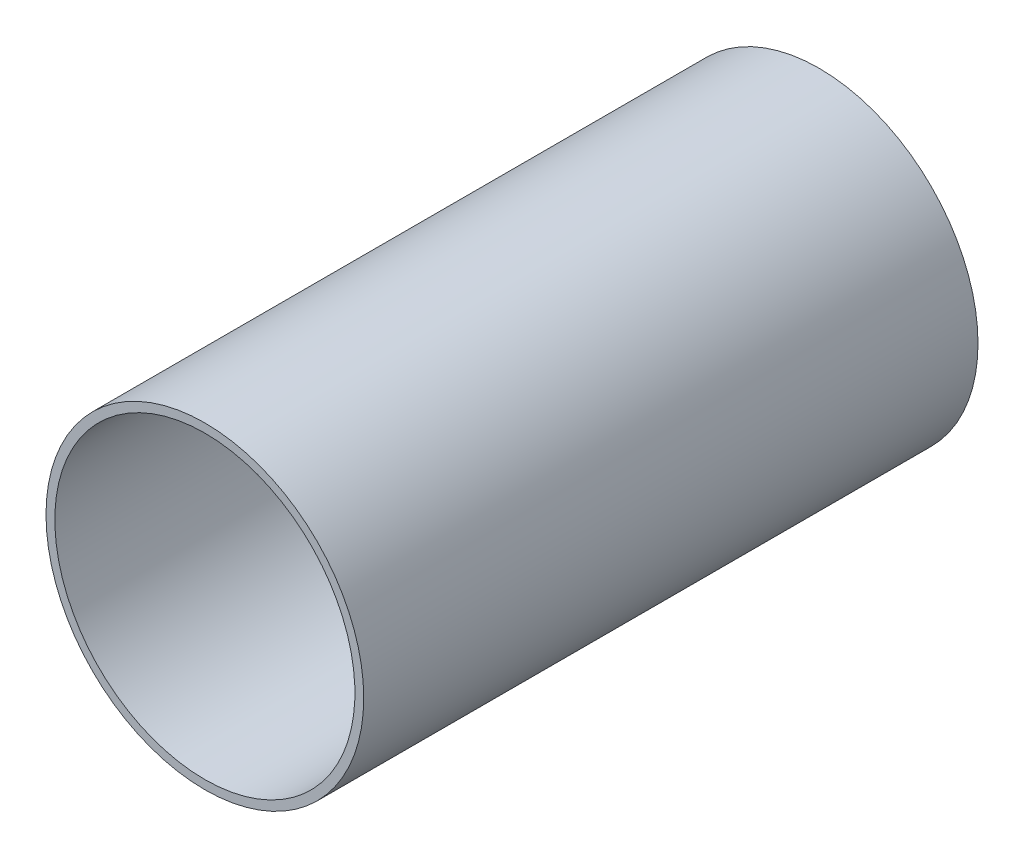
ISO-10303-21;
HEADER;
FILE_DESCRIPTION(('STEP AP214'),'2;1');
FILE_NAME('part.step','',(''),(''),'','','');
FILE_SCHEMA(('AUTOMOTIVE_DESIGN { 1 0 10303 214 1 1 1 1 }'));
ENDSEC;
DATA;
#1=APPLICATION_CONTEXT('core data for automotive mechanical design processes');
#2=APPLICATION_PROTOCOL_DEFINITION('international standard','automotive_design',2000,#1);
#3=PRODUCT_CONTEXT('',#1,'mechanical');
#4=PRODUCT('Part','Part','',(#3));
#5=PRODUCT_RELATED_PRODUCT_CATEGORY('part','',(#4));
#6=PRODUCT_DEFINITION_FORMATION('','',#4);
#7=PRODUCT_DEFINITION_CONTEXT('part definition',#1,'design');
#8=PRODUCT_DEFINITION('design','',#6,#7);
#9=PRODUCT_DEFINITION_SHAPE('','',#8);
#10=(LENGTH_UNIT() NAMED_UNIT(*) SI_UNIT(.MILLI.,.METRE.));
#11=(NAMED_UNIT(*) PLANE_ANGLE_UNIT() SI_UNIT($,.RADIAN.));
#12=(NAMED_UNIT(*) SI_UNIT($,.STERADIAN.) SOLID_ANGLE_UNIT());
#13=UNCERTAINTY_MEASURE_WITH_UNIT(LENGTH_MEASURE(1.E-05),#10,'distance_accuracy_value','');
#14=(GEOMETRIC_REPRESENTATION_CONTEXT(3) GLOBAL_UNCERTAINTY_ASSIGNED_CONTEXT((#13)) GLOBAL_UNIT_ASSIGNED_CONTEXT((#10,
#11,#12)) REPRESENTATION_CONTEXT('',''));
#15=CARTESIAN_POINT('',(0.,0.,0.));
#16=DIRECTION('',(0.,0.,1.));
#17=DIRECTION('',(1.,0.,0.));
#18=AXIS2_PLACEMENT_3D('',#15,#16,#17);
#19=CARTESIAN_POINT('',(170.3578,-71.2108,-0.045));
#20=DIRECTION('',(0.,0.,-1.));
#21=DIRECTION('',(0.,-1.,0.));
#22=AXIS2_PLACEMENT_3D('',#19,#20,#21);
#23=CYLINDRICAL_SURFACE('',#22,0.425);
#24=CARTESIAN_POINT('',(170.3578,-71.2108,-0.035));
#25=DIRECTION('',(0.,0.,-1.));
#26=DIRECTION('',(0.,-1.,0.));
#27=AXIS2_PLACEMENT_3D('',#24,#25,#26);
#28=CIRCLE('',#27,0.425);
#29=CARTESIAN_POINT('',(170.3578,-71.6358,-0.035));
#30=VERTEX_POINT('',#29);
#31=EDGE_CURVE('E64',#30,#30,#28,.T.);
#32=ORIENTED_EDGE('',*,*,#31,.T.);
#33=DIRECTION('',(0.,0.,1.));
#34=VECTOR('',#33,1.);
#35=CARTESIAN_POINT('',(170.3578,-71.6358,-0.045));
#36=LINE('',#35,#34);
#37=CARTESIAN_POINT('',(170.3578,-71.6358,1.705));
#38=VERTEX_POINT('',#37);
#39=EDGE_CURVE('E11',#30,#38,#36,.T.);
#40=ORIENTED_EDGE('',*,*,#39,.T.);
#41=CARTESIAN_POINT('',(170.3578,-71.2108,1.705));
#42=DIRECTION('',(0.,0.,-1.));
#43=DIRECTION('',(0.,-1.,0.));
#44=AXIS2_PLACEMENT_3D('',#41,#42,#43);
#45=CIRCLE('',#44,0.425);
#46=EDGE_CURVE('E25',#38,#38,#45,.T.);
#47=ORIENTED_EDGE('',*,*,#46,.F.);
#48=ORIENTED_EDGE('',*,*,#39,.F.);
#49=EDGE_LOOP('',(#32,#40,#47,#48));
#50=FACE_BOUND('',#49,.T.);
#51=ADVANCED_FACE('F17',(#50),#23,.F.);
#52=CARTESIAN_POINT('',(170.3578,-71.6608,1.705));
#53=DIRECTION('',(0.,0.,1.));
#54=DIRECTION('',(1.,0.,0.));
#55=AXIS2_PLACEMENT_3D('',#52,#53,#54);
#56=PLANE('',#55);
#57=ORIENTED_EDGE('',*,*,#46,.T.);
#58=EDGE_LOOP('',(#57));
#59=FACE_BOUND('',#58,.T.);
#60=CARTESIAN_POINT('',(170.3578,-71.2108,1.705));
#61=DIRECTION('',(0.,0.,1.));
#62=DIRECTION('',(0.,-1.,0.));
#63=AXIS2_PLACEMENT_3D('',#60,#61,#62);
#64=CIRCLE('',#63,0.45);
#65=CARTESIAN_POINT('',(170.3578,-71.6608,1.705));
#66=VERTEX_POINT('',#65);
#67=EDGE_CURVE('E56',#66,#66,#64,.T.);
#68=ORIENTED_EDGE('',*,*,#67,.T.);
#69=EDGE_LOOP('',(#68));
#70=FACE_BOUND('',#69,.T.);
#71=ADVANCED_FACE('F76',(#59,#70),#56,.T.);
#72=CARTESIAN_POINT('',(170.3578,-71.6608,-0.035));
#73=DIRECTION('',(0.,0.,1.));
#74=DIRECTION('',(1.,0.,0.));
#75=AXIS2_PLACEMENT_3D('',#72,#73,#74);
#76=PLANE('',#75);
#77=ORIENTED_EDGE('',*,*,#31,.F.);
#78=EDGE_LOOP('',(#77));
#79=FACE_BOUND('',#78,.T.);
#80=CARTESIAN_POINT('',(170.3578,-71.2108,-0.035));
#81=DIRECTION('',(0.,0.,1.));
#82=DIRECTION('',(0.,-1.,0.));
#83=AXIS2_PLACEMENT_3D('',#80,#81,#82);
#84=CIRCLE('',#83,0.45);
#85=CARTESIAN_POINT('',(170.3578,-71.6608,-0.035));
#86=VERTEX_POINT('',#85);
#87=EDGE_CURVE('E55',#86,#86,#84,.T.);
#88=ORIENTED_EDGE('',*,*,#87,.F.);
#89=EDGE_LOOP('',(#88));
#90=FACE_BOUND('',#89,.T.);
#91=ADVANCED_FACE('F84',(#79,#90),#76,.F.);
#92=CARTESIAN_POINT('',(170.3578,-71.2108,-0.035));
#93=DIRECTION('',(0.,0.,-1.));
#94=DIRECTION('',(0.,-1.,0.));
#95=AXIS2_PLACEMENT_3D('',#92,#93,#94);
#96=CYLINDRICAL_SURFACE('',#95,0.45);
#97=ORIENTED_EDGE('',*,*,#87,.T.);
#98=DIRECTION('',(0.,0.,1.));
#99=VECTOR('',#98,1.);
#100=CARTESIAN_POINT('',(170.3578,-71.6608,-0.035));
#101=LINE('',#100,#99);
#102=EDGE_CURVE('E52',#86,#66,#101,.T.);
#103=ORIENTED_EDGE('',*,*,#102,.T.);
#104=ORIENTED_EDGE('',*,*,#67,.F.);
#105=ORIENTED_EDGE('',*,*,#102,.F.);
#106=EDGE_LOOP('',(#97,#103,#104,#105));
#107=FACE_BOUND('',#106,.T.);
#108=ADVANCED_FACE('F53',(#107),#96,.T.);
#109=CLOSED_SHELL('',(#51,#71,#91,#108));
#110=MANIFOLD_SOLID_BREP('B1',#109);
#111=ADVANCED_BREP_SHAPE_REPRESENTATION('',(#18,#110),#14);
#112=SHAPE_DEFINITION_REPRESENTATION(#9,#111);
ENDSEC;
END-ISO-10303-21;
